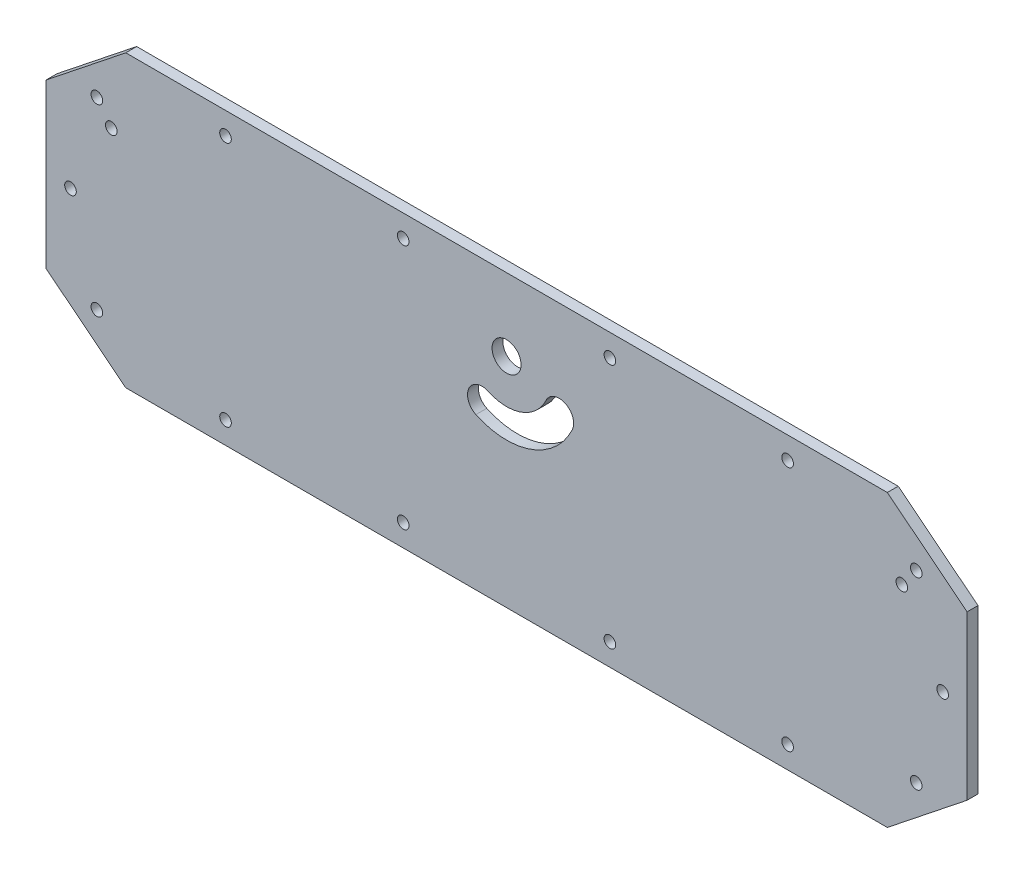
ISO-10303-21;
HEADER;
FILE_DESCRIPTION(('STEP AP214'),'2;1');
FILE_NAME('part.step','',(''),(''),'','','');
FILE_SCHEMA(('AUTOMOTIVE_DESIGN { 1 0 10303 214 1 1 1 1 }'));
ENDSEC;
DATA;
#1=APPLICATION_CONTEXT('core data for automotive mechanical design processes');
#2=APPLICATION_PROTOCOL_DEFINITION('international standard','automotive_design',2000,#1);
#3=PRODUCT_CONTEXT('',#1,'mechanical');
#4=PRODUCT('Part','Part','',(#3));
#5=PRODUCT_RELATED_PRODUCT_CATEGORY('part','',(#4));
#6=PRODUCT_DEFINITION_FORMATION('','',#4);
#7=PRODUCT_DEFINITION_CONTEXT('part definition',#1,'design');
#8=PRODUCT_DEFINITION('design','',#6,#7);
#9=PRODUCT_DEFINITION_SHAPE('','',#8);
#10=(LENGTH_UNIT() NAMED_UNIT(*) SI_UNIT(.MILLI.,.METRE.));
#11=(NAMED_UNIT(*) PLANE_ANGLE_UNIT() SI_UNIT($,.RADIAN.));
#12=(NAMED_UNIT(*) SI_UNIT($,.STERADIAN.) SOLID_ANGLE_UNIT());
#13=UNCERTAINTY_MEASURE_WITH_UNIT(LENGTH_MEASURE(1.E-05),#10,'distance_accuracy_value','');
#14=(GEOMETRIC_REPRESENTATION_CONTEXT(3) GLOBAL_UNCERTAINTY_ASSIGNED_CONTEXT((#13)) GLOBAL_UNIT_ASSIGNED_CONTEXT((#10,
#11,#12)) REPRESENTATION_CONTEXT('',''));
#15=CARTESIAN_POINT('',(0.,0.,0.));
#16=DIRECTION('',(0.,0.,1.));
#17=DIRECTION('',(1.,0.,0.));
#18=AXIS2_PLACEMENT_3D('',#15,#16,#17);
#19=CARTESIAN_POINT('',(-127.,40.,3.));
#20=DIRECTION('',(0.,0.,-1.));
#21=DIRECTION('',(-1.,0.,0.));
#22=AXIS2_PLACEMENT_3D('',#19,#20,#21);
#23=PLANE('',#22);
#24=CARTESIAN_POINT('',(-109.,20.,3.));
#25=DIRECTION('',(0.,0.,1.));
#26=DIRECTION('',(1.,0.,0.));
#27=AXIS2_PLACEMENT_3D('',#24,#25,#26);
#28=CIRCLE('',#27,1.6);
#29=CARTESIAN_POINT('',(-107.4,20.,3.));
#30=VERTEX_POINT('',#29);
#31=EDGE_CURVE('E149',#30,#30,#28,.T.);
#32=ORIENTED_EDGE('',*,*,#31,.F.);
#33=EDGE_LOOP('',(#32));
#34=FACE_BOUND('',#33,.T.);
#35=CARTESIAN_POINT('',(77.5,33.9,3.));
#36=DIRECTION('',(0.,0.,1.));
#37=DIRECTION('',(1.,0.,0.));
#38=AXIS2_PLACEMENT_3D('',#35,#36,#37);
#39=CIRCLE('',#38,1.60000000000001);
#40=CARTESIAN_POINT('',(79.1,33.9,3.));
#41=VERTEX_POINT('',#40);
#42=EDGE_CURVE('E159',#41,#41,#39,.T.);
#43=ORIENTED_EDGE('',*,*,#42,.F.);
#44=EDGE_LOOP('',(#43));
#45=FACE_BOUND('',#44,.T.);
#46=CARTESIAN_POINT('',(-28.5,33.9,3.));
#47=DIRECTION('',(0.,0.,1.));
#48=DIRECTION('',(1.,0.,0.));
#49=AXIS2_PLACEMENT_3D('',#46,#47,#48);
#50=CIRCLE('',#49,1.6);
#51=CARTESIAN_POINT('',(-26.9,33.9,3.));
#52=VERTEX_POINT('',#51);
#53=EDGE_CURVE('E171',#52,#52,#50,.T.);
#54=ORIENTED_EDGE('',*,*,#53,.F.);
#55=EDGE_LOOP('',(#54));
#56=FACE_BOUND('',#55,.T.);
#57=CARTESIAN_POINT('',(-112.98,25.35,3.));
#58=DIRECTION('',(0.,0.,1.));
#59=DIRECTION('',(1.,0.,0.));
#60=AXIS2_PLACEMENT_3D('',#57,#58,#59);
#61=CIRCLE('',#60,1.6);
#62=CARTESIAN_POINT('',(-111.38,25.35,3.));
#63=VERTEX_POINT('',#62);
#64=EDGE_CURVE('E183',#63,#63,#61,.T.);
#65=ORIENTED_EDGE('',*,*,#64,.F.);
#66=EDGE_LOOP('',(#65));
#67=FACE_BOUND('',#66,.T.);
#68=CARTESIAN_POINT('',(-112.98,-25.35,3.));
#69=DIRECTION('',(0.,0.,1.));
#70=DIRECTION('',(1.,0.,0.));
#71=AXIS2_PLACEMENT_3D('',#68,#69,#70);
#72=CIRCLE('',#71,1.6);
#73=CARTESIAN_POINT('',(-111.38,-25.35,3.));
#74=VERTEX_POINT('',#73);
#75=EDGE_CURVE('E195',#74,#74,#72,.T.);
#76=ORIENTED_EDGE('',*,*,#75,.F.);
#77=EDGE_LOOP('',(#76));
#78=FACE_BOUND('',#77,.T.);
#79=CARTESIAN_POINT('',(-28.5,-33.9,3.));
#80=DIRECTION('',(0.,0.,1.));
#81=DIRECTION('',(1.,0.,0.));
#82=AXIS2_PLACEMENT_3D('',#79,#80,#81);
#83=CIRCLE('',#82,1.6);
#84=CARTESIAN_POINT('',(-26.9,-33.9,3.));
#85=VERTEX_POINT('',#84);
#86=EDGE_CURVE('E207',#85,#85,#83,.T.);
#87=ORIENTED_EDGE('',*,*,#86,.F.);
#88=EDGE_LOOP('',(#87));
#89=FACE_BOUND('',#88,.T.);
#90=CARTESIAN_POINT('',(77.5,-33.9,3.));
#91=DIRECTION('',(0.,0.,1.));
#92=DIRECTION('',(1.,0.,0.));
#93=AXIS2_PLACEMENT_3D('',#90,#91,#92);
#94=CIRCLE('',#93,1.60000000000001);
#95=CARTESIAN_POINT('',(79.1000000000001,-33.9,3.));
#96=VERTEX_POINT('',#95);
#97=EDGE_CURVE('E219',#96,#96,#94,.T.);
#98=ORIENTED_EDGE('',*,*,#97,.F.);
#99=EDGE_LOOP('',(#98));
#100=FACE_BOUND('',#99,.T.);
#101=CARTESIAN_POINT('',(120.25,0.,3.));
#102=DIRECTION('',(0.,0.,1.));
#103=DIRECTION('',(1.,0.,0.));
#104=AXIS2_PLACEMENT_3D('',#101,#102,#103);
#105=CIRCLE('',#104,1.60000000000001);
#106=CARTESIAN_POINT('',(121.85,0.,3.));
#107=VERTEX_POINT('',#106);
#108=EDGE_CURVE('E231',#107,#107,#105,.T.);
#109=ORIENTED_EDGE('',*,*,#108,.F.);
#110=EDGE_LOOP('',(#109));
#111=FACE_BOUND('',#110,.T.);
#112=CARTESIAN_POINT('',(0.,20.,3.));
#113=DIRECTION('',(0.,0.,1.));
#114=DIRECTION('',(1.,0.,0.));
#115=AXIS2_PLACEMENT_3D('',#112,#113,#114);
#116=CIRCLE('',#115,4.);
#117=CARTESIAN_POINT('',(4.00000000000002,20.,3.));
#118=VERTEX_POINT('',#117);
#119=EDGE_CURVE('E243',#118,#118,#116,.T.);
#120=ORIENTED_EDGE('',*,*,#119,.F.);
#121=EDGE_LOOP('',(#120));
#122=FACE_BOUND('',#121,.T.);
#123=DIRECTION('',(0.,-1.,0.));
#124=VECTOR('',#123,1.);
#125=CARTESIAN_POINT('',(-127.,-22.5,3.));
#126=LINE('',#125,#124);
#127=CARTESIAN_POINT('',(-127.,22.5,3.));
#128=VERTEX_POINT('',#127);
#129=CARTESIAN_POINT('',(-127.,-22.5,3.));
#130=VERTEX_POINT('',#129);
#131=EDGE_CURVE('E249',#128,#130,#126,.T.);
#132=ORIENTED_EDGE('',*,*,#131,.T.);
#133=DIRECTION('',(0.782601054175647,-0.62252356582154,0.));
#134=VECTOR('',#133,1.);
#135=CARTESIAN_POINT('',(-105.,-40.,3.));
#136=LINE('',#135,#134);
#137=CARTESIAN_POINT('',(-105.,-40.,3.));
#138=VERTEX_POINT('',#137);
#139=EDGE_CURVE('E252',#130,#138,#136,.T.);
#140=ORIENTED_EDGE('',*,*,#139,.T.);
#141=DIRECTION('',(1.,0.,0.));
#142=VECTOR('',#141,1.);
#143=CARTESIAN_POINT('',(105.,-40.,3.));
#144=LINE('',#143,#142);
#145=CARTESIAN_POINT('',(105.,-40.,3.));
#146=VERTEX_POINT('',#145);
#147=EDGE_CURVE('E255',#138,#146,#144,.T.);
#148=ORIENTED_EDGE('',*,*,#147,.T.);
#149=DIRECTION('',(0.782601054175648,0.622523565821539,0.));
#150=VECTOR('',#149,1.);
#151=CARTESIAN_POINT('',(127.,-22.5,3.));
#152=LINE('',#151,#150);
#153=CARTESIAN_POINT('',(127.,-22.5,3.));
#154=VERTEX_POINT('',#153);
#155=EDGE_CURVE('E257',#146,#154,#152,.T.);
#156=ORIENTED_EDGE('',*,*,#155,.T.);
#157=DIRECTION('',(0.,1.,0.));
#158=VECTOR('',#157,1.);
#159=CARTESIAN_POINT('',(127.,22.5,3.));
#160=LINE('',#159,#158);
#161=CARTESIAN_POINT('',(127.,22.5,3.));
#162=VERTEX_POINT('',#161);
#163=EDGE_CURVE('E259',#154,#162,#160,.T.);
#164=ORIENTED_EDGE('',*,*,#163,.T.);
#165=DIRECTION('',(-0.782601054175648,0.622523565821539,0.));
#166=VECTOR('',#165,1.);
#167=CARTESIAN_POINT('',(105.,40.,3.));
#168=LINE('',#167,#166);
#169=CARTESIAN_POINT('',(105.,40.,3.));
#170=VERTEX_POINT('',#169);
#171=EDGE_CURVE('E261',#162,#170,#168,.T.);
#172=ORIENTED_EDGE('',*,*,#171,.T.);
#173=DIRECTION('',(-1.,0.,0.));
#174=VECTOR('',#173,1.);
#175=CARTESIAN_POINT('',(-105.,40.,3.));
#176=LINE('',#175,#174);
#177=CARTESIAN_POINT('',(-105.,40.,3.));
#178=VERTEX_POINT('',#177);
#179=EDGE_CURVE('E263',#170,#178,#176,.T.);
#180=ORIENTED_EDGE('',*,*,#179,.T.);
#181=DIRECTION('',(-0.782601054175648,-0.622523565821539,0.));
#182=VECTOR('',#181,1.);
#183=CARTESIAN_POINT('',(-127.,22.5,3.));
#184=LINE('',#183,#182);
#185=EDGE_CURVE('E265',#178,#128,#184,.T.);
#186=ORIENTED_EDGE('',*,*,#185,.T.);
#187=EDGE_LOOP('',(#132,#140,#148,#156,#164,#172,#180,#186));
#188=FACE_BOUND('',#187,.T.);
#189=CARTESIAN_POINT('',(112.98,25.35,3.));
#190=DIRECTION('',(0.,0.,1.));
#191=DIRECTION('',(1.,0.,0.));
#192=AXIS2_PLACEMENT_3D('',#189,#190,#191);
#193=CIRCLE('',#192,1.6);
#194=CARTESIAN_POINT('',(114.58,25.35,3.));
#195=VERTEX_POINT('',#194);
#196=EDGE_CURVE('E237',#195,#195,#193,.T.);
#197=ORIENTED_EDGE('',*,*,#196,.F.);
#198=EDGE_LOOP('',(#197));
#199=FACE_BOUND('',#198,.T.);
#200=CARTESIAN_POINT('',(112.98,-25.35,3.));
#201=DIRECTION('',(0.,0.,1.));
#202=DIRECTION('',(1.,0.,0.));
#203=AXIS2_PLACEMENT_3D('',#200,#201,#202);
#204=CIRCLE('',#203,1.6);
#205=CARTESIAN_POINT('',(114.58,-25.35,3.));
#206=VERTEX_POINT('',#205);
#207=EDGE_CURVE('E225',#206,#206,#204,.T.);
#208=ORIENTED_EDGE('',*,*,#207,.F.);
#209=EDGE_LOOP('',(#208));
#210=FACE_BOUND('',#209,.T.);
#211=CARTESIAN_POINT('',(28.5,-33.9,3.));
#212=DIRECTION('',(0.,0.,1.));
#213=DIRECTION('',(1.,0.,0.));
#214=AXIS2_PLACEMENT_3D('',#211,#212,#213);
#215=CIRCLE('',#214,1.6);
#216=CARTESIAN_POINT('',(30.1,-33.9,3.));
#217=VERTEX_POINT('',#216);
#218=EDGE_CURVE('E213',#217,#217,#215,.T.);
#219=ORIENTED_EDGE('',*,*,#218,.F.);
#220=EDGE_LOOP('',(#219));
#221=FACE_BOUND('',#220,.T.);
#222=CARTESIAN_POINT('',(-77.5,-33.9,3.));
#223=DIRECTION('',(0.,0.,1.));
#224=DIRECTION('',(1.,0.,0.));
#225=AXIS2_PLACEMENT_3D('',#222,#223,#224);
#226=CIRCLE('',#225,1.60000000000001);
#227=CARTESIAN_POINT('',(-75.8999999999999,-33.9,3.));
#228=VERTEX_POINT('',#227);
#229=EDGE_CURVE('E201',#228,#228,#226,.T.);
#230=ORIENTED_EDGE('',*,*,#229,.F.);
#231=EDGE_LOOP('',(#230));
#232=FACE_BOUND('',#231,.T.);
#233=CARTESIAN_POINT('',(-120.25,0.,3.));
#234=DIRECTION('',(0.,0.,1.));
#235=DIRECTION('',(1.,0.,0.));
#236=AXIS2_PLACEMENT_3D('',#233,#234,#235);
#237=CIRCLE('',#236,1.60000000000001);
#238=CARTESIAN_POINT('',(-118.65,0.,3.));
#239=VERTEX_POINT('',#238);
#240=EDGE_CURVE('E189',#239,#239,#237,.T.);
#241=ORIENTED_EDGE('',*,*,#240,.F.);
#242=EDGE_LOOP('',(#241));
#243=FACE_BOUND('',#242,.T.);
#244=CARTESIAN_POINT('',(-77.5,33.9,3.));
#245=DIRECTION('',(0.,0.,1.));
#246=DIRECTION('',(1.,0.,0.));
#247=AXIS2_PLACEMENT_3D('',#244,#245,#246);
#248=CIRCLE('',#247,1.60000000000001);
#249=CARTESIAN_POINT('',(-75.9,33.9,3.));
#250=VERTEX_POINT('',#249);
#251=EDGE_CURVE('E177',#250,#250,#248,.T.);
#252=ORIENTED_EDGE('',*,*,#251,.F.);
#253=EDGE_LOOP('',(#252));
#254=FACE_BOUND('',#253,.T.);
#255=CARTESIAN_POINT('',(28.5,33.9,3.));
#256=DIRECTION('',(0.,0.,1.));
#257=DIRECTION('',(1.,0.,0.));
#258=AXIS2_PLACEMENT_3D('',#255,#256,#257);
#259=CIRCLE('',#258,1.6);
#260=CARTESIAN_POINT('',(30.1,33.9,3.));
#261=VERTEX_POINT('',#260);
#262=EDGE_CURVE('E165',#261,#261,#259,.T.);
#263=ORIENTED_EDGE('',*,*,#262,.F.);
#264=EDGE_LOOP('',(#263));
#265=FACE_BOUND('',#264,.T.);
#266=CARTESIAN_POINT('',(-6.76189218785118,5.4990754074136,3.));
#267=DIRECTION('',(0.,0.,1.));
#268=DIRECTION('',(1.,0.,0.));
#269=AXIS2_PLACEMENT_3D('',#266,#267,#268);
#270=CIRCLE('',#269,4.);
#271=CARTESIAN_POINT('',(-5.07141914088838,9.12430655556021,3.));
#272=VERTEX_POINT('',#271);
#273=CARTESIAN_POINT('',(-8.45236523481398,1.873844259267,3.));
#274=VERTEX_POINT('',#273);
#275=EDGE_CURVE('E120',#272,#274,#270,.T.);
#276=ORIENTED_EDGE('',*,*,#275,.F.);
#277=CARTESIAN_POINT('',(0.,20.,3.));
#278=DIRECTION('',(0.,0.,-1.));
#279=DIRECTION('',(1.,0.,0.));
#280=AXIS2_PLACEMENT_3D('',#277,#278,#279);
#281=CIRCLE('',#280,12.);
#282=CARTESIAN_POINT('',(10.8756934444398,14.9285808591116,3.));
#283=VERTEX_POINT('',#282);
#284=EDGE_CURVE('E143',#283,#272,#281,.T.);
#285=ORIENTED_EDGE('',*,*,#284,.F.);
#286=CARTESIAN_POINT('',(14.5009245925864,13.2381078121489,3.));
#287=DIRECTION('',(0.,0.,1.));
#288=DIRECTION('',(1.,0.,0.));
#289=AXIS2_PLACEMENT_3D('',#286,#287,#288);
#290=CIRCLE('',#289,4.);
#291=CARTESIAN_POINT('',(18.126155740733,11.547634765186,3.));
#292=VERTEX_POINT('',#291);
#293=EDGE_CURVE('E141',#292,#283,#290,.T.);
#294=ORIENTED_EDGE('',*,*,#293,.F.);
#295=CARTESIAN_POINT('',(0.,20.,3.));
#296=DIRECTION('',(0.,0.,1.));
#297=DIRECTION('',(1.,0.,0.));
#298=AXIS2_PLACEMENT_3D('',#295,#296,#297);
#299=CIRCLE('',#298,20.);
#300=EDGE_CURVE('E128',#274,#292,#299,.T.);
#301=ORIENTED_EDGE('',*,*,#300,.F.);
#302=EDGE_LOOP('',(#276,#285,#294,#301));
#303=FACE_BOUND('',#302,.T.);
#304=CARTESIAN_POINT('',(109.,20.,3.));
#305=DIRECTION('',(0.,0.,1.));
#306=DIRECTION('',(1.,0.,0.));
#307=AXIS2_PLACEMENT_3D('',#304,#305,#306);
#308=CIRCLE('',#307,1.6);
#309=CARTESIAN_POINT('',(110.6,20.,3.));
#310=VERTEX_POINT('',#309);
#311=EDGE_CURVE('E458',#310,#310,#308,.T.);
#312=ORIENTED_EDGE('',*,*,#311,.F.);
#313=EDGE_LOOP('',(#312));
#314=FACE_BOUND('',#313,.T.);
#315=ADVANCED_FACE('F31',(#34,#45,#56,#67,#78,#89,#100,#111,#122,#188,#199,#210,#221,#232,#243,
#254,#265,#303,#314),#23,.F.);
#316=CARTESIAN_POINT('',(-127.,40.,0.));
#317=DIRECTION('',(0.,0.,-1.));
#318=DIRECTION('',(-1.,0.,0.));
#319=AXIS2_PLACEMENT_3D('',#316,#317,#318);
#320=PLANE('',#319);
#321=CARTESIAN_POINT('',(-109.,20.,0.));
#322=DIRECTION('',(0.,0.,1.));
#323=DIRECTION('',(1.,0.,0.));
#324=AXIS2_PLACEMENT_3D('',#321,#322,#323);
#325=CIRCLE('',#324,1.6);
#326=CARTESIAN_POINT('',(-107.4,20.,0.));
#327=VERTEX_POINT('',#326);
#328=EDGE_CURVE('E464',#327,#327,#325,.T.);
#329=ORIENTED_EDGE('',*,*,#328,.T.);
#330=EDGE_LOOP('',(#329));
#331=FACE_BOUND('',#330,.T.);
#332=CARTESIAN_POINT('',(77.5,33.9,0.));
#333=DIRECTION('',(0.,0.,1.));
#334=DIRECTION('',(1.,0.,0.));
#335=AXIS2_PLACEMENT_3D('',#332,#333,#334);
#336=CIRCLE('',#335,1.60000000000001);
#337=CARTESIAN_POINT('',(79.1,33.9,0.));
#338=VERTEX_POINT('',#337);
#339=EDGE_CURVE('E136',#338,#338,#336,.T.);
#340=ORIENTED_EDGE('',*,*,#339,.T.);
#341=EDGE_LOOP('',(#340));
#342=FACE_BOUND('',#341,.T.);
#343=CARTESIAN_POINT('',(-28.5,33.9,0.));
#344=DIRECTION('',(0.,0.,1.));
#345=DIRECTION('',(1.,0.,0.));
#346=AXIS2_PLACEMENT_3D('',#343,#344,#345);
#347=CIRCLE('',#346,1.6);
#348=CARTESIAN_POINT('',(-26.9,33.9,0.));
#349=VERTEX_POINT('',#348);
#350=EDGE_CURVE('E168',#349,#349,#347,.T.);
#351=ORIENTED_EDGE('',*,*,#350,.T.);
#352=EDGE_LOOP('',(#351));
#353=FACE_BOUND('',#352,.T.);
#354=CARTESIAN_POINT('',(-112.98,25.35,0.));
#355=DIRECTION('',(0.,0.,1.));
#356=DIRECTION('',(1.,0.,0.));
#357=AXIS2_PLACEMENT_3D('',#354,#355,#356);
#358=CIRCLE('',#357,1.6);
#359=CARTESIAN_POINT('',(-111.38,25.35,0.));
#360=VERTEX_POINT('',#359);
#361=EDGE_CURVE('E180',#360,#360,#358,.T.);
#362=ORIENTED_EDGE('',*,*,#361,.T.);
#363=EDGE_LOOP('',(#362));
#364=FACE_BOUND('',#363,.T.);
#365=CARTESIAN_POINT('',(-112.98,-25.35,0.));
#366=DIRECTION('',(0.,0.,1.));
#367=DIRECTION('',(1.,0.,0.));
#368=AXIS2_PLACEMENT_3D('',#365,#366,#367);
#369=CIRCLE('',#368,1.6);
#370=CARTESIAN_POINT('',(-111.38,-25.35,0.));
#371=VERTEX_POINT('',#370);
#372=EDGE_CURVE('E192',#371,#371,#369,.T.);
#373=ORIENTED_EDGE('',*,*,#372,.T.);
#374=EDGE_LOOP('',(#373));
#375=FACE_BOUND('',#374,.T.);
#376=CARTESIAN_POINT('',(-28.5,-33.9,0.));
#377=DIRECTION('',(0.,0.,1.));
#378=DIRECTION('',(1.,0.,0.));
#379=AXIS2_PLACEMENT_3D('',#376,#377,#378);
#380=CIRCLE('',#379,1.6);
#381=CARTESIAN_POINT('',(-26.9,-33.9,0.));
#382=VERTEX_POINT('',#381);
#383=EDGE_CURVE('E204',#382,#382,#380,.T.);
#384=ORIENTED_EDGE('',*,*,#383,.T.);
#385=EDGE_LOOP('',(#384));
#386=FACE_BOUND('',#385,.T.);
#387=CARTESIAN_POINT('',(77.5,-33.9,0.));
#388=DIRECTION('',(0.,0.,1.));
#389=DIRECTION('',(1.,0.,0.));
#390=AXIS2_PLACEMENT_3D('',#387,#388,#389);
#391=CIRCLE('',#390,1.60000000000001);
#392=CARTESIAN_POINT('',(79.1000000000001,-33.9,0.));
#393=VERTEX_POINT('',#392);
#394=EDGE_CURVE('E216',#393,#393,#391,.T.);
#395=ORIENTED_EDGE('',*,*,#394,.T.);
#396=EDGE_LOOP('',(#395));
#397=FACE_BOUND('',#396,.T.);
#398=CARTESIAN_POINT('',(120.25,0.,0.));
#399=DIRECTION('',(0.,0.,1.));
#400=DIRECTION('',(1.,0.,0.));
#401=AXIS2_PLACEMENT_3D('',#398,#399,#400);
#402=CIRCLE('',#401,1.60000000000001);
#403=CARTESIAN_POINT('',(121.85,0.,0.));
#404=VERTEX_POINT('',#403);
#405=EDGE_CURVE('E228',#404,#404,#402,.T.);
#406=ORIENTED_EDGE('',*,*,#405,.T.);
#407=EDGE_LOOP('',(#406));
#408=FACE_BOUND('',#407,.T.);
#409=CARTESIAN_POINT('',(0.,20.,0.));
#410=DIRECTION('',(0.,0.,1.));
#411=DIRECTION('',(1.,0.,0.));
#412=AXIS2_PLACEMENT_3D('',#409,#410,#411);
#413=CIRCLE('',#412,4.);
#414=CARTESIAN_POINT('',(4.00000000000002,20.,0.));
#415=VERTEX_POINT('',#414);
#416=EDGE_CURVE('E240',#415,#415,#413,.T.);
#417=ORIENTED_EDGE('',*,*,#416,.T.);
#418=EDGE_LOOP('',(#417));
#419=FACE_BOUND('',#418,.T.);
#420=DIRECTION('',(0.,-1.,0.));
#421=VECTOR('',#420,1.);
#422=CARTESIAN_POINT('',(-127.,-22.5,0.));
#423=LINE('',#422,#421);
#424=CARTESIAN_POINT('',(-127.,22.5,0.));
#425=VERTEX_POINT('',#424);
#426=CARTESIAN_POINT('',(-127.,-22.5,0.));
#427=VERTEX_POINT('',#426);
#428=EDGE_CURVE('E246',#425,#427,#423,.T.);
#429=ORIENTED_EDGE('',*,*,#428,.F.);
#430=DIRECTION('',(-0.782601054175648,-0.622523565821539,0.));
#431=VECTOR('',#430,1.);
#432=CARTESIAN_POINT('',(-127.,22.5,0.));
#433=LINE('',#432,#431);
#434=CARTESIAN_POINT('',(-105.,40.,0.));
#435=VERTEX_POINT('',#434);
#436=EDGE_CURVE('E253',#435,#425,#433,.T.);
#437=ORIENTED_EDGE('',*,*,#436,.F.);
#438=DIRECTION('',(-1.,0.,0.));
#439=VECTOR('',#438,1.);
#440=CARTESIAN_POINT('',(-105.,40.,0.));
#441=LINE('',#440,#439);
#442=CARTESIAN_POINT('',(105.,40.,0.));
#443=VERTEX_POINT('',#442);
#444=EDGE_CURVE('E280',#443,#435,#441,.T.);
#445=ORIENTED_EDGE('',*,*,#444,.F.);
#446=DIRECTION('',(-0.782601054175648,0.622523565821539,0.));
#447=VECTOR('',#446,1.);
#448=CARTESIAN_POINT('',(105.,40.,0.));
#449=LINE('',#448,#447);
#450=CARTESIAN_POINT('',(127.,22.5,0.));
#451=VERTEX_POINT('',#450);
#452=EDGE_CURVE('E278',#451,#443,#449,.T.);
#453=ORIENTED_EDGE('',*,*,#452,.F.);
#454=DIRECTION('',(0.,1.,0.));
#455=VECTOR('',#454,1.);
#456=CARTESIAN_POINT('',(127.,22.5,0.));
#457=LINE('',#456,#455);
#458=CARTESIAN_POINT('',(127.,-22.5,0.));
#459=VERTEX_POINT('',#458);
#460=EDGE_CURVE('E276',#459,#451,#457,.T.);
#461=ORIENTED_EDGE('',*,*,#460,.F.);
#462=DIRECTION('',(0.782601054175648,0.622523565821539,0.));
#463=VECTOR('',#462,1.);
#464=CARTESIAN_POINT('',(127.,-22.5,0.));
#465=LINE('',#464,#463);
#466=CARTESIAN_POINT('',(105.,-40.,0.));
#467=VERTEX_POINT('',#466);
#468=EDGE_CURVE('E274',#467,#459,#465,.T.);
#469=ORIENTED_EDGE('',*,*,#468,.F.);
#470=DIRECTION('',(1.,0.,0.));
#471=VECTOR('',#470,1.);
#472=CARTESIAN_POINT('',(105.,-40.,0.));
#473=LINE('',#472,#471);
#474=CARTESIAN_POINT('',(-105.,-40.,0.));
#475=VERTEX_POINT('',#474);
#476=EDGE_CURVE('E272',#475,#467,#473,.T.);
#477=ORIENTED_EDGE('',*,*,#476,.F.);
#478=DIRECTION('',(0.782601054175647,-0.62252356582154,0.));
#479=VECTOR('',#478,1.);
#480=CARTESIAN_POINT('',(-105.,-40.,0.));
#481=LINE('',#480,#479);
#482=EDGE_CURVE('E270',#427,#475,#481,.T.);
#483=ORIENTED_EDGE('',*,*,#482,.F.);
#484=EDGE_LOOP('',(#429,#437,#445,#453,#461,#469,#477,#483));
#485=FACE_BOUND('',#484,.T.);
#486=CARTESIAN_POINT('',(112.98,25.35,0.));
#487=DIRECTION('',(0.,0.,1.));
#488=DIRECTION('',(1.,0.,0.));
#489=AXIS2_PLACEMENT_3D('',#486,#487,#488);
#490=CIRCLE('',#489,1.6);
#491=CARTESIAN_POINT('',(114.58,25.35,0.));
#492=VERTEX_POINT('',#491);
#493=EDGE_CURVE('E234',#492,#492,#490,.T.);
#494=ORIENTED_EDGE('',*,*,#493,.T.);
#495=EDGE_LOOP('',(#494));
#496=FACE_BOUND('',#495,.T.);
#497=CARTESIAN_POINT('',(112.98,-25.35,0.));
#498=DIRECTION('',(0.,0.,1.));
#499=DIRECTION('',(1.,0.,0.));
#500=AXIS2_PLACEMENT_3D('',#497,#498,#499);
#501=CIRCLE('',#500,1.6);
#502=CARTESIAN_POINT('',(114.58,-25.35,0.));
#503=VERTEX_POINT('',#502);
#504=EDGE_CURVE('E222',#503,#503,#501,.T.);
#505=ORIENTED_EDGE('',*,*,#504,.T.);
#506=EDGE_LOOP('',(#505));
#507=FACE_BOUND('',#506,.T.);
#508=CARTESIAN_POINT('',(28.5,-33.9,0.));
#509=DIRECTION('',(0.,0.,1.));
#510=DIRECTION('',(1.,0.,0.));
#511=AXIS2_PLACEMENT_3D('',#508,#509,#510);
#512=CIRCLE('',#511,1.6);
#513=CARTESIAN_POINT('',(30.1,-33.9,0.));
#514=VERTEX_POINT('',#513);
#515=EDGE_CURVE('E210',#514,#514,#512,.T.);
#516=ORIENTED_EDGE('',*,*,#515,.T.);
#517=EDGE_LOOP('',(#516));
#518=FACE_BOUND('',#517,.T.);
#519=CARTESIAN_POINT('',(-77.5,-33.9,0.));
#520=DIRECTION('',(0.,0.,1.));
#521=DIRECTION('',(1.,0.,0.));
#522=AXIS2_PLACEMENT_3D('',#519,#520,#521);
#523=CIRCLE('',#522,1.60000000000001);
#524=CARTESIAN_POINT('',(-75.8999999999999,-33.9,0.));
#525=VERTEX_POINT('',#524);
#526=EDGE_CURVE('E198',#525,#525,#523,.T.);
#527=ORIENTED_EDGE('',*,*,#526,.T.);
#528=EDGE_LOOP('',(#527));
#529=FACE_BOUND('',#528,.T.);
#530=CARTESIAN_POINT('',(-120.25,0.,0.));
#531=DIRECTION('',(0.,0.,1.));
#532=DIRECTION('',(1.,0.,0.));
#533=AXIS2_PLACEMENT_3D('',#530,#531,#532);
#534=CIRCLE('',#533,1.60000000000001);
#535=CARTESIAN_POINT('',(-118.65,0.,0.));
#536=VERTEX_POINT('',#535);
#537=EDGE_CURVE('E186',#536,#536,#534,.T.);
#538=ORIENTED_EDGE('',*,*,#537,.T.);
#539=EDGE_LOOP('',(#538));
#540=FACE_BOUND('',#539,.T.);
#541=CARTESIAN_POINT('',(-77.5,33.9,0.));
#542=DIRECTION('',(0.,0.,1.));
#543=DIRECTION('',(1.,0.,0.));
#544=AXIS2_PLACEMENT_3D('',#541,#542,#543);
#545=CIRCLE('',#544,1.60000000000001);
#546=CARTESIAN_POINT('',(-75.9,33.9,0.));
#547=VERTEX_POINT('',#546);
#548=EDGE_CURVE('E174',#547,#547,#545,.T.);
#549=ORIENTED_EDGE('',*,*,#548,.T.);
#550=EDGE_LOOP('',(#549));
#551=FACE_BOUND('',#550,.T.);
#552=CARTESIAN_POINT('',(28.5,33.9,0.));
#553=DIRECTION('',(0.,0.,1.));
#554=DIRECTION('',(1.,0.,0.));
#555=AXIS2_PLACEMENT_3D('',#552,#553,#554);
#556=CIRCLE('',#555,1.6);
#557=CARTESIAN_POINT('',(30.1,33.9,0.));
#558=VERTEX_POINT('',#557);
#559=EDGE_CURVE('E162',#558,#558,#556,.T.);
#560=ORIENTED_EDGE('',*,*,#559,.T.);
#561=EDGE_LOOP('',(#560));
#562=FACE_BOUND('',#561,.T.);
#563=CARTESIAN_POINT('',(0.,20.,0.));
#564=DIRECTION('',(0.,0.,-1.));
#565=DIRECTION('',(1.,0.,0.));
#566=AXIS2_PLACEMENT_3D('',#563,#564,#565);
#567=CIRCLE('',#566,12.);
#568=CARTESIAN_POINT('',(10.8756934444398,14.9285808591116,0.));
#569=VERTEX_POINT('',#568);
#570=CARTESIAN_POINT('',(-5.07141914088838,9.12430655556021,0.));
#571=VERTEX_POINT('',#570);
#572=EDGE_CURVE('E129',#569,#571,#567,.T.);
#573=ORIENTED_EDGE('',*,*,#572,.T.);
#574=CARTESIAN_POINT('',(-6.76189218785118,5.4990754074136,0.));
#575=DIRECTION('',(0.,0.,1.));
#576=DIRECTION('',(1.,0.,0.));
#577=AXIS2_PLACEMENT_3D('',#574,#575,#576);
#578=CIRCLE('',#577,4.);
#579=CARTESIAN_POINT('',(-8.45236523481398,1.873844259267,0.));
#580=VERTEX_POINT('',#579);
#581=EDGE_CURVE('E54',#571,#580,#578,.T.);
#582=ORIENTED_EDGE('',*,*,#581,.T.);
#583=CARTESIAN_POINT('',(0.,20.,0.));
#584=DIRECTION('',(0.,0.,1.));
#585=DIRECTION('',(1.,0.,0.));
#586=AXIS2_PLACEMENT_3D('',#583,#584,#585);
#587=CIRCLE('',#586,20.);
#588=CARTESIAN_POINT('',(18.126155740733,11.547634765186,0.));
#589=VERTEX_POINT('',#588);
#590=EDGE_CURVE('E135',#580,#589,#587,.T.);
#591=ORIENTED_EDGE('',*,*,#590,.T.);
#592=CARTESIAN_POINT('',(14.5009245925864,13.2381078121489,0.));
#593=DIRECTION('',(0.,0.,1.));
#594=DIRECTION('',(1.,0.,0.));
#595=AXIS2_PLACEMENT_3D('',#592,#593,#594);
#596=CIRCLE('',#595,4.);
#597=EDGE_CURVE('E151',#589,#569,#596,.T.);
#598=ORIENTED_EDGE('',*,*,#597,.T.);
#599=EDGE_LOOP('',(#573,#582,#591,#598));
#600=FACE_BOUND('',#599,.T.);
#601=CARTESIAN_POINT('',(109.,20.,0.));
#602=DIRECTION('',(0.,0.,1.));
#603=DIRECTION('',(1.,0.,0.));
#604=AXIS2_PLACEMENT_3D('',#601,#602,#603);
#605=CIRCLE('',#604,1.6);
#606=CARTESIAN_POINT('',(110.6,20.,0.));
#607=VERTEX_POINT('',#606);
#608=EDGE_CURVE('E461',#607,#607,#605,.T.);
#609=ORIENTED_EDGE('',*,*,#608,.T.);
#610=EDGE_LOOP('',(#609));
#611=FACE_BOUND('',#610,.T.);
#612=ADVANCED_FACE('F310',(#331,#342,#353,#364,#375,#386,#397,#408,#419,#485,#496,#507,#518,
#529,#540,#551,#562,#600,#611),#320,.T.);
#613=CARTESIAN_POINT('',(-127.,-22.5,3.));
#614=DIRECTION('',(1.,0.,0.));
#615=DIRECTION('',(0.,0.,-1.));
#616=AXIS2_PLACEMENT_3D('',#613,#614,#615);
#617=PLANE('',#616);
#618=ORIENTED_EDGE('',*,*,#428,.T.);
#619=DIRECTION('',(0.,0.,-1.));
#620=VECTOR('',#619,1.);
#621=CARTESIAN_POINT('',(-127.,-22.5,3.));
#622=LINE('',#621,#620);
#623=EDGE_CURVE('E11',#130,#427,#622,.T.);
#624=ORIENTED_EDGE('',*,*,#623,.F.);
#625=ORIENTED_EDGE('',*,*,#131,.F.);
#626=DIRECTION('',(0.,0.,-1.));
#627=VECTOR('',#626,1.);
#628=CARTESIAN_POINT('',(-127.,22.5,3.));
#629=LINE('',#628,#627);
#630=EDGE_CURVE('E267',#128,#425,#629,.T.);
#631=ORIENTED_EDGE('',*,*,#630,.T.);
#632=EDGE_LOOP('',(#618,#624,#625,#631));
#633=FACE_BOUND('',#632,.T.);
#634=ADVANCED_FACE('F33',(#633),#617,.F.);
#635=CARTESIAN_POINT('',(-105.,-40.,3.));
#636=DIRECTION('',(0.62252356582154,0.782601054175647,0.));
#637=DIRECTION('',(-0.782601054175648,0.62252356582154,0.));
#638=AXIS2_PLACEMENT_3D('',#635,#636,#637);
#639=PLANE('',#638);
#640=ORIENTED_EDGE('',*,*,#482,.T.);
#641=DIRECTION('',(0.,0.,-1.));
#642=VECTOR('',#641,1.);
#643=CARTESIAN_POINT('',(-105.,-40.,3.));
#644=LINE('',#643,#642);
#645=EDGE_CURVE('E39',#138,#475,#644,.T.);
#646=ORIENTED_EDGE('',*,*,#645,.F.);
#647=ORIENTED_EDGE('',*,*,#139,.F.);
#648=ORIENTED_EDGE('',*,*,#623,.T.);
#649=EDGE_LOOP('',(#640,#646,#647,#648));
#650=FACE_BOUND('',#649,.T.);
#651=ADVANCED_FACE('F328',(#650),#639,.F.);
#652=CARTESIAN_POINT('',(105.,-40.,3.));
#653=DIRECTION('',(0.,1.,0.));
#654=DIRECTION('',(-1.,0.,0.));
#655=AXIS2_PLACEMENT_3D('',#652,#653,#654);
#656=PLANE('',#655);
#657=ORIENTED_EDGE('',*,*,#476,.T.);
#658=DIRECTION('',(0.,0.,-1.));
#659=VECTOR('',#658,1.);
#660=CARTESIAN_POINT('',(105.,-40.,3.));
#661=LINE('',#660,#659);
#662=EDGE_CURVE('E297',#146,#467,#661,.T.);
#663=ORIENTED_EDGE('',*,*,#662,.F.);
#664=ORIENTED_EDGE('',*,*,#147,.F.);
#665=ORIENTED_EDGE('',*,*,#645,.T.);
#666=EDGE_LOOP('',(#657,#663,#664,#665));
#667=FACE_BOUND('',#666,.T.);
#668=ADVANCED_FACE('F304',(#667),#656,.F.);
#669=CARTESIAN_POINT('',(127.,-22.5,3.));
#670=DIRECTION('',(-0.622523565821539,0.782601054175648,0.));
#671=DIRECTION('',(-0.782601054175649,-0.622523565821539,0.));
#672=AXIS2_PLACEMENT_3D('',#669,#670,#671);
#673=PLANE('',#672);
#674=ORIENTED_EDGE('',*,*,#468,.T.);
#675=DIRECTION('',(0.,0.,-1.));
#676=VECTOR('',#675,1.);
#677=CARTESIAN_POINT('',(127.,-22.5,3.));
#678=LINE('',#677,#676);
#679=EDGE_CURVE('E294',#154,#459,#678,.T.);
#680=ORIENTED_EDGE('',*,*,#679,.F.);
#681=ORIENTED_EDGE('',*,*,#155,.F.);
#682=ORIENTED_EDGE('',*,*,#662,.T.);
#683=EDGE_LOOP('',(#674,#680,#681,#682));
#684=FACE_BOUND('',#683,.T.);
#685=ADVANCED_FACE('F316',(#684),#673,.F.);
#686=CARTESIAN_POINT('',(127.,22.5,3.));
#687=DIRECTION('',(-1.,0.,0.));
#688=DIRECTION('',(0.,0.,1.));
#689=AXIS2_PLACEMENT_3D('',#686,#687,#688);
#690=PLANE('',#689);
#691=ORIENTED_EDGE('',*,*,#460,.T.);
#692=DIRECTION('',(0.,0.,-1.));
#693=VECTOR('',#692,1.);
#694=CARTESIAN_POINT('',(127.,22.5,3.));
#695=LINE('',#694,#693);
#696=EDGE_CURVE('E291',#162,#451,#695,.T.);
#697=ORIENTED_EDGE('',*,*,#696,.F.);
#698=ORIENTED_EDGE('',*,*,#163,.F.);
#699=ORIENTED_EDGE('',*,*,#679,.T.);
#700=EDGE_LOOP('',(#691,#697,#698,#699));
#701=FACE_BOUND('',#700,.T.);
#702=ADVANCED_FACE('F320',(#701),#690,.F.);
#703=CARTESIAN_POINT('',(105.,40.,3.));
#704=DIRECTION('',(-0.622523565821539,-0.782601054175649,0.));
#705=DIRECTION('',(0.782601054175649,-0.622523565821539,0.));
#706=AXIS2_PLACEMENT_3D('',#703,#704,#705);
#707=PLANE('',#706);
#708=ORIENTED_EDGE('',*,*,#452,.T.);
#709=DIRECTION('',(0.,0.,-1.));
#710=VECTOR('',#709,1.);
#711=CARTESIAN_POINT('',(105.,40.,3.));
#712=LINE('',#711,#710);
#713=EDGE_CURVE('E288',#170,#443,#712,.T.);
#714=ORIENTED_EDGE('',*,*,#713,.F.);
#715=ORIENTED_EDGE('',*,*,#171,.F.);
#716=ORIENTED_EDGE('',*,*,#696,.T.);
#717=EDGE_LOOP('',(#708,#714,#715,#716));
#718=FACE_BOUND('',#717,.T.);
#719=ADVANCED_FACE('F341',(#718),#707,.F.);
#720=CARTESIAN_POINT('',(-105.,40.,3.));
#721=DIRECTION('',(0.,-1.,0.));
#722=DIRECTION('',(1.,0.,0.));
#723=AXIS2_PLACEMENT_3D('',#720,#721,#722);
#724=PLANE('',#723);
#725=ORIENTED_EDGE('',*,*,#444,.T.);
#726=DIRECTION('',(0.,0.,-1.));
#727=VECTOR('',#726,1.);
#728=CARTESIAN_POINT('',(-105.,40.,3.));
#729=LINE('',#728,#727);
#730=EDGE_CURVE('E285',#178,#435,#729,.T.);
#731=ORIENTED_EDGE('',*,*,#730,.F.);
#732=ORIENTED_EDGE('',*,*,#179,.F.);
#733=ORIENTED_EDGE('',*,*,#713,.T.);
#734=EDGE_LOOP('',(#725,#731,#732,#733));
#735=FACE_BOUND('',#734,.T.);
#736=ADVANCED_FACE('F339',(#735),#724,.F.);
#737=CARTESIAN_POINT('',(-127.,22.5,3.));
#738=DIRECTION('',(0.622523565821539,-0.782601054175648,0.));
#739=DIRECTION('',(0.782601054175649,0.622523565821539,0.));
#740=AXIS2_PLACEMENT_3D('',#737,#738,#739);
#741=PLANE('',#740);
#742=ORIENTED_EDGE('',*,*,#436,.T.);
#743=ORIENTED_EDGE('',*,*,#630,.F.);
#744=ORIENTED_EDGE('',*,*,#185,.F.);
#745=ORIENTED_EDGE('',*,*,#730,.T.);
#746=EDGE_LOOP('',(#742,#743,#744,#745));
#747=FACE_BOUND('',#746,.T.);
#748=ADVANCED_FACE('F334',(#747),#741,.F.);
#749=CARTESIAN_POINT('',(0.,20.,3.));
#750=DIRECTION('',(0.,0.,-1.));
#751=DIRECTION('',(-1.,0.,0.));
#752=AXIS2_PLACEMENT_3D('',#749,#750,#751);
#753=CYLINDRICAL_SURFACE('',#752,4.);
#754=ORIENTED_EDGE('',*,*,#119,.T.);
#755=EDGE_LOOP('',(#754));
#756=FACE_BOUND('',#755,.T.);
#757=ORIENTED_EDGE('',*,*,#416,.F.);
#758=EDGE_LOOP('',(#757));
#759=FACE_BOUND('',#758,.T.);
#760=ADVANCED_FACE('F361',(#756,#759),#753,.F.);
#761=CARTESIAN_POINT('',(112.98,25.35,3.));
#762=DIRECTION('',(0.,0.,-1.));
#763=DIRECTION('',(-1.,0.,0.));
#764=AXIS2_PLACEMENT_3D('',#761,#762,#763);
#765=CYLINDRICAL_SURFACE('',#764,1.6);
#766=ORIENTED_EDGE('',*,*,#196,.T.);
#767=EDGE_LOOP('',(#766));
#768=FACE_BOUND('',#767,.T.);
#769=ORIENTED_EDGE('',*,*,#493,.F.);
#770=EDGE_LOOP('',(#769));
#771=FACE_BOUND('',#770,.T.);
#772=ADVANCED_FACE('F368',(#768,#771),#765,.F.);
#773=CARTESIAN_POINT('',(120.25,0.,3.));
#774=DIRECTION('',(0.,0.,-1.));
#775=DIRECTION('',(-1.,0.,0.));
#776=AXIS2_PLACEMENT_3D('',#773,#774,#775);
#777=CYLINDRICAL_SURFACE('',#776,1.60000000000001);
#778=ORIENTED_EDGE('',*,*,#108,.T.);
#779=EDGE_LOOP('',(#778));
#780=FACE_BOUND('',#779,.T.);
#781=ORIENTED_EDGE('',*,*,#405,.F.);
#782=EDGE_LOOP('',(#781));
#783=FACE_BOUND('',#782,.T.);
#784=ADVANCED_FACE('F373',(#780,#783),#777,.F.);
#785=CARTESIAN_POINT('',(112.98,-25.35,3.));
#786=DIRECTION('',(0.,0.,-1.));
#787=DIRECTION('',(-1.,0.,0.));
#788=AXIS2_PLACEMENT_3D('',#785,#786,#787);
#789=CYLINDRICAL_SURFACE('',#788,1.6);
#790=ORIENTED_EDGE('',*,*,#207,.T.);
#791=EDGE_LOOP('',(#790));
#792=FACE_BOUND('',#791,.T.);
#793=ORIENTED_EDGE('',*,*,#504,.F.);
#794=EDGE_LOOP('',(#793));
#795=FACE_BOUND('',#794,.T.);
#796=ADVANCED_FACE('F383',(#792,#795),#789,.F.);
#797=CARTESIAN_POINT('',(77.5,-33.9,3.));
#798=DIRECTION('',(0.,0.,-1.));
#799=DIRECTION('',(-1.,0.,0.));
#800=AXIS2_PLACEMENT_3D('',#797,#798,#799);
#801=CYLINDRICAL_SURFACE('',#800,1.60000000000001);
#802=ORIENTED_EDGE('',*,*,#97,.T.);
#803=EDGE_LOOP('',(#802));
#804=FACE_BOUND('',#803,.T.);
#805=ORIENTED_EDGE('',*,*,#394,.F.);
#806=EDGE_LOOP('',(#805));
#807=FACE_BOUND('',#806,.T.);
#808=ADVANCED_FACE('F390',(#804,#807),#801,.F.);
#809=CARTESIAN_POINT('',(28.5,-33.9,3.));
#810=DIRECTION('',(0.,0.,-1.));
#811=DIRECTION('',(-1.,0.,0.));
#812=AXIS2_PLACEMENT_3D('',#809,#810,#811);
#813=CYLINDRICAL_SURFACE('',#812,1.6);
#814=ORIENTED_EDGE('',*,*,#218,.T.);
#815=EDGE_LOOP('',(#814));
#816=FACE_BOUND('',#815,.T.);
#817=ORIENTED_EDGE('',*,*,#515,.F.);
#818=EDGE_LOOP('',(#817));
#819=FACE_BOUND('',#818,.T.);
#820=ADVANCED_FACE('F394',(#816,#819),#813,.F.);
#821=CARTESIAN_POINT('',(-28.5,-33.9,3.));
#822=DIRECTION('',(0.,0.,-1.));
#823=DIRECTION('',(-1.,0.,0.));
#824=AXIS2_PLACEMENT_3D('',#821,#822,#823);
#825=CYLINDRICAL_SURFACE('',#824,1.6);
#826=ORIENTED_EDGE('',*,*,#86,.T.);
#827=EDGE_LOOP('',(#826));
#828=FACE_BOUND('',#827,.T.);
#829=ORIENTED_EDGE('',*,*,#383,.F.);
#830=EDGE_LOOP('',(#829));
#831=FACE_BOUND('',#830,.T.);
#832=ADVANCED_FACE('F398',(#828,#831),#825,.F.);
#833=CARTESIAN_POINT('',(-77.5,-33.9,3.));
#834=DIRECTION('',(0.,0.,-1.));
#835=DIRECTION('',(-1.,0.,0.));
#836=AXIS2_PLACEMENT_3D('',#833,#834,#835);
#837=CYLINDRICAL_SURFACE('',#836,1.60000000000001);
#838=ORIENTED_EDGE('',*,*,#229,.T.);
#839=EDGE_LOOP('',(#838));
#840=FACE_BOUND('',#839,.T.);
#841=ORIENTED_EDGE('',*,*,#526,.F.);
#842=EDGE_LOOP('',(#841));
#843=FACE_BOUND('',#842,.T.);
#844=ADVANCED_FACE('F402',(#840,#843),#837,.F.);
#845=CARTESIAN_POINT('',(-112.98,-25.35,3.));
#846=DIRECTION('',(0.,0.,-1.));
#847=DIRECTION('',(-1.,0.,0.));
#848=AXIS2_PLACEMENT_3D('',#845,#846,#847);
#849=CYLINDRICAL_SURFACE('',#848,1.6);
#850=ORIENTED_EDGE('',*,*,#75,.T.);
#851=EDGE_LOOP('',(#850));
#852=FACE_BOUND('',#851,.T.);
#853=ORIENTED_EDGE('',*,*,#372,.F.);
#854=EDGE_LOOP('',(#853));
#855=FACE_BOUND('',#854,.T.);
#856=ADVANCED_FACE('F406',(#852,#855),#849,.F.);
#857=CARTESIAN_POINT('',(-120.25,0.,3.));
#858=DIRECTION('',(0.,0.,-1.));
#859=DIRECTION('',(-1.,0.,0.));
#860=AXIS2_PLACEMENT_3D('',#857,#858,#859);
#861=CYLINDRICAL_SURFACE('',#860,1.60000000000001);
#862=ORIENTED_EDGE('',*,*,#240,.T.);
#863=EDGE_LOOP('',(#862));
#864=FACE_BOUND('',#863,.T.);
#865=ORIENTED_EDGE('',*,*,#537,.F.);
#866=EDGE_LOOP('',(#865));
#867=FACE_BOUND('',#866,.T.);
#868=ADVANCED_FACE('F410',(#864,#867),#861,.F.);
#869=CARTESIAN_POINT('',(-112.98,25.35,3.));
#870=DIRECTION('',(0.,0.,-1.));
#871=DIRECTION('',(-1.,0.,0.));
#872=AXIS2_PLACEMENT_3D('',#869,#870,#871);
#873=CYLINDRICAL_SURFACE('',#872,1.6);
#874=ORIENTED_EDGE('',*,*,#64,.T.);
#875=EDGE_LOOP('',(#874));
#876=FACE_BOUND('',#875,.T.);
#877=ORIENTED_EDGE('',*,*,#361,.F.);
#878=EDGE_LOOP('',(#877));
#879=FACE_BOUND('',#878,.T.);
#880=ADVANCED_FACE('F414',(#876,#879),#873,.F.);
#881=CARTESIAN_POINT('',(-77.5,33.9,3.));
#882=DIRECTION('',(0.,0.,-1.));
#883=DIRECTION('',(-1.,0.,0.));
#884=AXIS2_PLACEMENT_3D('',#881,#882,#883);
#885=CYLINDRICAL_SURFACE('',#884,1.60000000000001);
#886=ORIENTED_EDGE('',*,*,#251,.T.);
#887=EDGE_LOOP('',(#886));
#888=FACE_BOUND('',#887,.T.);
#889=ORIENTED_EDGE('',*,*,#548,.F.);
#890=EDGE_LOOP('',(#889));
#891=FACE_BOUND('',#890,.T.);
#892=ADVANCED_FACE('F418',(#888,#891),#885,.F.);
#893=CARTESIAN_POINT('',(-28.5,33.9,3.));
#894=DIRECTION('',(0.,0.,-1.));
#895=DIRECTION('',(-1.,0.,0.));
#896=AXIS2_PLACEMENT_3D('',#893,#894,#895);
#897=CYLINDRICAL_SURFACE('',#896,1.6);
#898=ORIENTED_EDGE('',*,*,#53,.T.);
#899=EDGE_LOOP('',(#898));
#900=FACE_BOUND('',#899,.T.);
#901=ORIENTED_EDGE('',*,*,#350,.F.);
#902=EDGE_LOOP('',(#901));
#903=FACE_BOUND('',#902,.T.);
#904=ADVANCED_FACE('F422',(#900,#903),#897,.F.);
#905=CARTESIAN_POINT('',(28.5,33.9,3.));
#906=DIRECTION('',(0.,0.,-1.));
#907=DIRECTION('',(-1.,0.,0.));
#908=AXIS2_PLACEMENT_3D('',#905,#906,#907);
#909=CYLINDRICAL_SURFACE('',#908,1.6);
#910=ORIENTED_EDGE('',*,*,#262,.T.);
#911=EDGE_LOOP('',(#910));
#912=FACE_BOUND('',#911,.T.);
#913=ORIENTED_EDGE('',*,*,#559,.F.);
#914=EDGE_LOOP('',(#913));
#915=FACE_BOUND('',#914,.T.);
#916=ADVANCED_FACE('F426',(#912,#915),#909,.F.);
#917=CARTESIAN_POINT('',(77.5,33.9,3.));
#918=DIRECTION('',(0.,0.,-1.));
#919=DIRECTION('',(-1.,0.,0.));
#920=AXIS2_PLACEMENT_3D('',#917,#918,#919);
#921=CYLINDRICAL_SURFACE('',#920,1.60000000000001);
#922=ORIENTED_EDGE('',*,*,#42,.T.);
#923=EDGE_LOOP('',(#922));
#924=FACE_BOUND('',#923,.T.);
#925=ORIENTED_EDGE('',*,*,#339,.F.);
#926=EDGE_LOOP('',(#925));
#927=FACE_BOUND('',#926,.T.);
#928=ADVANCED_FACE('F430',(#924,#927),#921,.F.);
#929=CARTESIAN_POINT('',(-6.76189218785118,5.4990754074136,3.));
#930=DIRECTION('',(0.,0.,-1.));
#931=DIRECTION('',(-1.,0.,0.));
#932=AXIS2_PLACEMENT_3D('',#929,#930,#931);
#933=CYLINDRICAL_SURFACE('',#932,4.);
#934=ORIENTED_EDGE('',*,*,#581,.F.);
#935=DIRECTION('',(0.,0.,-1.));
#936=VECTOR('',#935,1.);
#937=CARTESIAN_POINT('',(-5.07141914088838,9.12430655556021,3.));
#938=LINE('',#937,#936);
#939=EDGE_CURVE('E124',#272,#571,#938,.T.);
#940=ORIENTED_EDGE('',*,*,#939,.F.);
#941=ORIENTED_EDGE('',*,*,#275,.T.);
#942=DIRECTION('',(0.,0.,-1.));
#943=VECTOR('',#942,1.);
#944=CARTESIAN_POINT('',(-8.45236523481398,1.873844259267,3.));
#945=LINE('',#944,#943);
#946=EDGE_CURVE('E123',#274,#580,#945,.T.);
#947=ORIENTED_EDGE('',*,*,#946,.T.);
#948=EDGE_LOOP('',(#934,#940,#941,#947));
#949=FACE_BOUND('',#948,.T.);
#950=ADVANCED_FACE('F122',(#949),#933,.F.);
#951=CARTESIAN_POINT('',(0.,20.,3.));
#952=DIRECTION('',(0.,0.,-1.));
#953=DIRECTION('',(-1.,0.,0.));
#954=AXIS2_PLACEMENT_3D('',#951,#952,#953);
#955=CYLINDRICAL_SURFACE('',#954,20.);
#956=ORIENTED_EDGE('',*,*,#590,.F.);
#957=ORIENTED_EDGE('',*,*,#946,.F.);
#958=ORIENTED_EDGE('',*,*,#300,.T.);
#959=DIRECTION('',(0.,0.,-1.));
#960=VECTOR('',#959,1.);
#961=CARTESIAN_POINT('',(18.126155740733,11.547634765186,3.));
#962=LINE('',#961,#960);
#963=EDGE_CURVE('E137',#292,#589,#962,.T.);
#964=ORIENTED_EDGE('',*,*,#963,.T.);
#965=EDGE_LOOP('',(#956,#957,#958,#964));
#966=FACE_BOUND('',#965,.T.);
#967=ADVANCED_FACE('F132',(#966),#955,.F.);
#968=CARTESIAN_POINT('',(14.5009245925864,13.2381078121489,3.));
#969=DIRECTION('',(0.,0.,-1.));
#970=DIRECTION('',(-1.,0.,0.));
#971=AXIS2_PLACEMENT_3D('',#968,#969,#970);
#972=CYLINDRICAL_SURFACE('',#971,4.);
#973=ORIENTED_EDGE('',*,*,#597,.F.);
#974=ORIENTED_EDGE('',*,*,#963,.F.);
#975=ORIENTED_EDGE('',*,*,#293,.T.);
#976=DIRECTION('',(0.,0.,-1.));
#977=VECTOR('',#976,1.);
#978=CARTESIAN_POINT('',(10.8756934444398,14.9285808591116,3.));
#979=LINE('',#978,#977);
#980=EDGE_CURVE('E46',#283,#569,#979,.T.);
#981=ORIENTED_EDGE('',*,*,#980,.T.);
#982=EDGE_LOOP('',(#973,#974,#975,#981));
#983=FACE_BOUND('',#982,.T.);
#984=ADVANCED_FACE('F439',(#983),#972,.F.);
#985=CARTESIAN_POINT('',(0.,20.,3.));
#986=DIRECTION('',(0.,0.,-1.));
#987=DIRECTION('',(-1.,0.,0.));
#988=AXIS2_PLACEMENT_3D('',#985,#986,#987);
#989=CYLINDRICAL_SURFACE('',#988,12.);
#990=ORIENTED_EDGE('',*,*,#572,.F.);
#991=ORIENTED_EDGE('',*,*,#980,.F.);
#992=ORIENTED_EDGE('',*,*,#284,.T.);
#993=ORIENTED_EDGE('',*,*,#939,.T.);
#994=EDGE_LOOP('',(#990,#991,#992,#993));
#995=FACE_BOUND('',#994,.T.);
#996=ADVANCED_FACE('F442',(#995),#989,.T.);
#997=CARTESIAN_POINT('',(-109.,20.,3.));
#998=DIRECTION('',(0.,0.,-1.));
#999=DIRECTION('',(-1.,0.,0.));
#1000=AXIS2_PLACEMENT_3D('',#997,#998,#999);
#1001=CYLINDRICAL_SURFACE('',#1000,1.6);
#1002=ORIENTED_EDGE('',*,*,#31,.T.);
#1003=EDGE_LOOP('',(#1002));
#1004=FACE_BOUND('',#1003,.T.);
#1005=ORIENTED_EDGE('',*,*,#328,.F.);
#1006=EDGE_LOOP('',(#1005));
#1007=FACE_BOUND('',#1006,.T.);
#1008=ADVANCED_FACE('F446',(#1004,#1007),#1001,.F.);
#1009=CARTESIAN_POINT('',(109.,20.,3.));
#1010=DIRECTION('',(0.,0.,-1.));
#1011=DIRECTION('',(-1.,0.,0.));
#1012=AXIS2_PLACEMENT_3D('',#1009,#1010,#1011);
#1013=CYLINDRICAL_SURFACE('',#1012,1.6);
#1014=ORIENTED_EDGE('',*,*,#311,.T.);
#1015=EDGE_LOOP('',(#1014));
#1016=FACE_BOUND('',#1015,.T.);
#1017=ORIENTED_EDGE('',*,*,#608,.F.);
#1018=EDGE_LOOP('',(#1017));
#1019=FACE_BOUND('',#1018,.T.);
#1020=ADVANCED_FACE('F449',(#1016,#1019),#1013,.F.);
#1021=CLOSED_SHELL('',(#315,#612,#634,#651,#668,#685,#702,#719,#736,#748,#760,#772,#784,#796,
#808,#820,#832,#844,#856,#868,#880,#892,#904,#916,#928,#950,#967,#984,#996,#1008,#1020));
#1022=MANIFOLD_SOLID_BREP('B2',#1021);
#1023=ADVANCED_BREP_SHAPE_REPRESENTATION('',(#18,#1022),#14);
#1024=SHAPE_DEFINITION_REPRESENTATION(#9,#1023);
ENDSEC;
END-ISO-10303-21;
